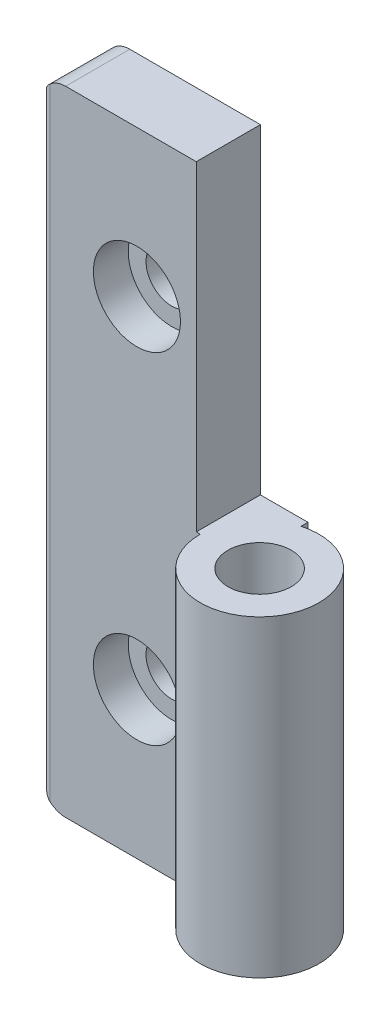
ISO-10303-21;
HEADER;
FILE_DESCRIPTION(('STEP AP214'),'2;1');
FILE_NAME('part.step','',(''),(''),'','','');
FILE_SCHEMA(('AUTOMOTIVE_DESIGN { 1 0 10303 214 1 1 1 1 }'));
ENDSEC;
DATA;
#1=APPLICATION_CONTEXT('core data for automotive mechanical design processes');
#2=APPLICATION_PROTOCOL_DEFINITION('international standard','automotive_design',2000,#1);
#3=PRODUCT_CONTEXT('',#1,'mechanical');
#4=PRODUCT('Part','Part','',(#3));
#5=PRODUCT_RELATED_PRODUCT_CATEGORY('part','',(#4));
#6=PRODUCT_DEFINITION_FORMATION('','',#4);
#7=PRODUCT_DEFINITION_CONTEXT('part definition',#1,'design');
#8=PRODUCT_DEFINITION('design','',#6,#7);
#9=PRODUCT_DEFINITION_SHAPE('','',#8);
#10=(LENGTH_UNIT() NAMED_UNIT(*) SI_UNIT(.MILLI.,.METRE.));
#11=(NAMED_UNIT(*) PLANE_ANGLE_UNIT() SI_UNIT($,.RADIAN.));
#12=(NAMED_UNIT(*) SI_UNIT($,.STERADIAN.) SOLID_ANGLE_UNIT());
#13=UNCERTAINTY_MEASURE_WITH_UNIT(LENGTH_MEASURE(1.E-05),#10,'distance_accuracy_value','');
#14=(GEOMETRIC_REPRESENTATION_CONTEXT(3) GLOBAL_UNCERTAINTY_ASSIGNED_CONTEXT((#13)) GLOBAL_UNIT_ASSIGNED_CONTEXT((#10,
#11,#12)) REPRESENTATION_CONTEXT('',''));
#15=CARTESIAN_POINT('',(0.,0.,0.));
#16=DIRECTION('',(0.,0.,1.));
#17=DIRECTION('',(1.,0.,0.));
#18=AXIS2_PLACEMENT_3D('',#15,#16,#17);
#19=CARTESIAN_POINT('',(0.,-0.5,0.));
#20=DIRECTION('',(0.,-1.,0.));
#21=DIRECTION('',(0.,0.,-1.));
#22=AXIS2_PLACEMENT_3D('',#19,#20,#21);
#23=PLANE('',#22);
#24=CARTESIAN_POINT('',(0.,-0.5,0.));
#25=DIRECTION('',(0.,-1.,0.));
#26=DIRECTION('',(0.,0.,-1.));
#27=AXIS2_PLACEMENT_3D('',#24,#25,#26);
#28=CIRCLE('',#27,3.99999999999998);
#29=CARTESIAN_POINT('',(0.,-0.5,-3.99999999999998));
#30=VERTEX_POINT('',#29);
#31=EDGE_CURVE('E147',#30,#30,#28,.T.);
#32=ORIENTED_EDGE('',*,*,#31,.T.);
#33=EDGE_LOOP('',(#32));
#34=FACE_BOUND('',#33,.T.);
#35=DIRECTION('',(0.,0.,-1.));
#36=VECTOR('',#35,1.);
#37=CARTESIAN_POINT('',(-8.,-0.5,-8.1));
#38=LINE('',#37,#36);
#39=CARTESIAN_POINT('',(-8.,-0.5,0.));
#40=VERTEX_POINT('',#39);
#41=CARTESIAN_POINT('',(-8.,-0.5,-8.1));
#42=VERTEX_POINT('',#41);
#43=EDGE_CURVE('E119',#40,#42,#38,.T.);
#44=ORIENTED_EDGE('',*,*,#43,.F.);
#45=DIRECTION('',(-1.,0.,0.));
#46=VECTOR('',#45,1.);
#47=CARTESIAN_POINT('',(-7.5,-0.5,0.));
#48=LINE('',#47,#46);
#49=CARTESIAN_POINT('',(-7.5,-0.5,0.));
#50=VERTEX_POINT('',#49);
#51=EDGE_CURVE('E126',#50,#40,#48,.T.);
#52=ORIENTED_EDGE('',*,*,#51,.F.);
#53=CARTESIAN_POINT('',(0.,-0.5,0.));
#54=DIRECTION('',(0.,-1.,0.));
#55=DIRECTION('',(0.,0.,-1.));
#56=AXIS2_PLACEMENT_3D('',#53,#54,#55);
#57=CIRCLE('',#56,7.5);
#58=CARTESIAN_POINT('',(-2.,-0.5,-7.22841614740048));
#59=VERTEX_POINT('',#58);
#60=EDGE_CURVE('E267',#59,#50,#57,.T.);
#61=ORIENTED_EDGE('',*,*,#60,.F.);
#62=DIRECTION('',(0.,0.,1.));
#63=VECTOR('',#62,1.);
#64=CARTESIAN_POINT('',(-2.,-0.5,-8.1));
#65=LINE('',#64,#63);
#66=CARTESIAN_POINT('',(-2.,-0.5,-8.1));
#67=VERTEX_POINT('',#66);
#68=EDGE_CURVE('E265',#67,#59,#65,.T.);
#69=ORIENTED_EDGE('',*,*,#68,.F.);
#70=DIRECTION('',(1.,0.,0.));
#71=VECTOR('',#70,1.);
#72=CARTESIAN_POINT('',(-27.5,-0.5,-8.1));
#73=LINE('',#72,#71);
#74=EDGE_CURVE('E259',#42,#67,#73,.T.);
#75=ORIENTED_EDGE('',*,*,#74,.F.);
#76=EDGE_LOOP('',(#44,#52,#61,#69,#75));
#77=FACE_BOUND('',#76,.T.);
#78=ADVANCED_FACE('F32',(#34,#77),#23,.F.);
#79=CARTESIAN_POINT('',(-27.5,-0.5,-8.1));
#80=DIRECTION('',(0.,0.,-1.));
#81=DIRECTION('',(-1.,0.,0.));
#82=AXIS2_PLACEMENT_3D('',#79,#80,#81);
#83=PLANE('',#82);
#84=CARTESIAN_POINT('',(-15.5,-21.5,-8.1));
#85=DIRECTION('',(0.,0.,-1.));
#86=DIRECTION('',(-1.,0.,0.));
#87=AXIS2_PLACEMENT_3D('',#84,#85,#86);
#88=CIRCLE('',#87,3.25000000000001);
#89=CARTESIAN_POINT('',(-18.75,-21.5,-8.1));
#90=VERTEX_POINT('',#89);
#91=EDGE_CURVE('E162',#90,#90,#88,.T.);
#92=ORIENTED_EDGE('',*,*,#91,.F.);
#93=EDGE_LOOP('',(#92));
#94=FACE_BOUND('',#93,.T.);
#95=CARTESIAN_POINT('',(-15.5,21.5,-8.1));
#96=DIRECTION('',(0.,0.,-1.));
#97=DIRECTION('',(-1.,0.,0.));
#98=AXIS2_PLACEMENT_3D('',#95,#96,#97);
#99=CIRCLE('',#98,3.25000000000001);
#100=CARTESIAN_POINT('',(-18.75,21.5,-8.1));
#101=VERTEX_POINT('',#100);
#102=EDGE_CURVE('E158',#101,#101,#99,.T.);
#103=ORIENTED_EDGE('',*,*,#102,.F.);
#104=EDGE_LOOP('',(#103));
#105=FACE_BOUND('',#104,.T.);
#106=DIRECTION('',(1.,0.,0.));
#107=VECTOR('',#106,1.);
#108=CARTESIAN_POINT('',(-27.5,-40.,-8.1));
#109=LINE('',#108,#107);
#110=CARTESIAN_POINT('',(-24.5,-40.,-8.1));
#111=VERTEX_POINT('',#110);
#112=CARTESIAN_POINT('',(-2.,-40.,-8.1));
#113=VERTEX_POINT('',#112);
#114=EDGE_CURVE('E129',#111,#113,#109,.T.);
#115=ORIENTED_EDGE('',*,*,#114,.F.);
#116=CARTESIAN_POINT('',(-24.5,-37.,-8.1));
#117=DIRECTION('',(0.,0.,-1.));
#118=DIRECTION('',(-1.,0.,0.));
#119=AXIS2_PLACEMENT_3D('',#116,#117,#118);
#120=CIRCLE('',#119,2.99999999999999);
#121=CARTESIAN_POINT('',(-27.5,-37.,-8.1));
#122=VERTEX_POINT('',#121);
#123=EDGE_CURVE('E178',#111,#122,#120,.T.);
#124=ORIENTED_EDGE('',*,*,#123,.T.);
#125=DIRECTION('',(0.,-1.,0.));
#126=VECTOR('',#125,1.);
#127=CARTESIAN_POINT('',(-27.5,-0.5,-8.1));
#128=LINE('',#127,#126);
#129=CARTESIAN_POINT('',(-27.5,37.,-8.1));
#130=VERTEX_POINT('',#129);
#131=EDGE_CURVE('E170',#130,#122,#128,.T.);
#132=ORIENTED_EDGE('',*,*,#131,.F.);
#133=CARTESIAN_POINT('',(-24.5,37.,-8.1));
#134=DIRECTION('',(0.,0.,-1.));
#135=DIRECTION('',(-1.,0.,0.));
#136=AXIS2_PLACEMENT_3D('',#133,#134,#135);
#137=CIRCLE('',#136,2.99999999999999);
#138=CARTESIAN_POINT('',(-24.5,40.,-8.1));
#139=VERTEX_POINT('',#138);
#140=EDGE_CURVE('E176',#130,#139,#137,.T.);
#141=ORIENTED_EDGE('',*,*,#140,.T.);
#142=DIRECTION('',(-1.,0.,0.));
#143=VECTOR('',#142,1.);
#144=CARTESIAN_POINT('',(-27.5,40.,-8.1));
#145=LINE('',#144,#143);
#146=CARTESIAN_POINT('',(-8.,40.,-8.1));
#147=VERTEX_POINT('',#146);
#148=EDGE_CURVE('E135',#147,#139,#145,.T.);
#149=ORIENTED_EDGE('',*,*,#148,.F.);
#150=DIRECTION('',(0.,-1.,0.));
#151=VECTOR('',#150,1.);
#152=CARTESIAN_POINT('',(-8.,40.,-8.1));
#153=LINE('',#152,#151);
#154=EDGE_CURVE('E130',#147,#42,#153,.T.);
#155=ORIENTED_EDGE('',*,*,#154,.T.);
#156=ORIENTED_EDGE('',*,*,#74,.T.);
#157=DIRECTION('',(0.,-1.,0.));
#158=VECTOR('',#157,1.);
#159=CARTESIAN_POINT('',(-2.,-0.5,-8.1));
#160=LINE('',#159,#158);
#161=EDGE_CURVE('E245',#67,#113,#160,.T.);
#162=ORIENTED_EDGE('',*,*,#161,.T.);
#163=EDGE_LOOP('',(#115,#124,#132,#141,#149,#155,#156,#162));
#164=FACE_BOUND('',#163,.T.);
#165=ADVANCED_FACE('F200',(#94,#105,#164),#83,.T.);
#166=CARTESIAN_POINT('',(-27.5,-0.5,0.));
#167=DIRECTION('',(-1.,0.,0.));
#168=DIRECTION('',(0.,0.,1.));
#169=AXIS2_PLACEMENT_3D('',#166,#167,#168);
#170=PLANE('',#169);
#171=ORIENTED_EDGE('',*,*,#131,.T.);
#172=DIRECTION('',(0.,0.,-1.));
#173=VECTOR('',#172,1.);
#174=CARTESIAN_POINT('',(-27.5,-37.,0.));
#175=LINE('',#174,#173);
#176=CARTESIAN_POINT('',(-27.5,-37.,-1.));
#177=VERTEX_POINT('',#176);
#178=EDGE_CURVE('E182',#122,#177,#175,.F.);
#179=ORIENTED_EDGE('',*,*,#178,.T.);
#180=DIRECTION('',(0.,-1.,0.));
#181=VECTOR('',#180,1.);
#182=CARTESIAN_POINT('',(-27.5,-0.5,-1.));
#183=LINE('',#182,#181);
#184=CARTESIAN_POINT('',(-27.5,37.,-1.));
#185=VERTEX_POINT('',#184);
#186=EDGE_CURVE('E169',#177,#185,#183,.F.);
#187=ORIENTED_EDGE('',*,*,#186,.T.);
#188=DIRECTION('',(0.,0.,1.));
#189=VECTOR('',#188,1.);
#190=CARTESIAN_POINT('',(-27.5,37.,-8.1));
#191=LINE('',#190,#189);
#192=EDGE_CURVE('E180',#185,#130,#191,.F.);
#193=ORIENTED_EDGE('',*,*,#192,.T.);
#194=EDGE_LOOP('',(#171,#179,#187,#193));
#195=FACE_BOUND('',#194,.T.);
#196=ADVANCED_FACE('F215',(#195),#170,.T.);
#197=CARTESIAN_POINT('',(-7.5,-0.5,0.));
#198=DIRECTION('',(0.,0.,1.));
#199=DIRECTION('',(1.,0.,0.));
#200=AXIS2_PLACEMENT_3D('',#197,#198,#199);
#201=PLANE('',#200);
#202=CARTESIAN_POINT('',(-15.5,-21.5,0.));
#203=DIRECTION('',(0.,0.,1.));
#204=DIRECTION('',(1.,0.,0.));
#205=AXIS2_PLACEMENT_3D('',#202,#203,#204);
#206=CIRCLE('',#205,5.49999999999999);
#207=CARTESIAN_POINT('',(-10.,-21.5,0.));
#208=VERTEX_POINT('',#207);
#209=EDGE_CURVE('E432',#208,#208,#206,.T.);
#210=ORIENTED_EDGE('',*,*,#209,.F.);
#211=EDGE_LOOP('',(#210));
#212=FACE_BOUND('',#211,.T.);
#213=CARTESIAN_POINT('',(-15.5,21.5,0.));
#214=DIRECTION('',(0.,0.,1.));
#215=DIRECTION('',(1.,0.,0.));
#216=AXIS2_PLACEMENT_3D('',#213,#214,#215);
#217=CIRCLE('',#216,5.49999999999999);
#218=CARTESIAN_POINT('',(-10.,21.5,0.));
#219=VERTEX_POINT('',#218);
#220=EDGE_CURVE('E165',#219,#219,#217,.T.);
#221=ORIENTED_EDGE('',*,*,#220,.F.);
#222=EDGE_LOOP('',(#221));
#223=FACE_BOUND('',#222,.T.);
#224=DIRECTION('',(0.,-1.,0.));
#225=VECTOR('',#224,1.);
#226=CARTESIAN_POINT('',(-26.5,-0.5,0.));
#227=LINE('',#226,#225);
#228=CARTESIAN_POINT('',(-26.5,39.2360679774998,0.));
#229=VERTEX_POINT('',#228);
#230=CARTESIAN_POINT('',(-26.5,-39.2360679774998,0.));
#231=VERTEX_POINT('',#230);
#232=EDGE_CURVE('E167',#229,#231,#227,.T.);
#233=ORIENTED_EDGE('',*,*,#232,.T.);
#234=CARTESIAN_POINT('',(-24.5,-37.,0.));
#235=DIRECTION('',(0.,0.,1.));
#236=DIRECTION('',(1.,0.,0.));
#237=AXIS2_PLACEMENT_3D('',#234,#235,#236);
#238=CIRCLE('',#237,2.99999999999999);
#239=CARTESIAN_POINT('',(-24.5,-40.,0.));
#240=VERTEX_POINT('',#239);
#241=EDGE_CURVE('E41',#231,#240,#238,.T.);
#242=ORIENTED_EDGE('',*,*,#241,.T.);
#243=DIRECTION('',(-1.,0.,0.));
#244=VECTOR('',#243,1.);
#245=CARTESIAN_POINT('',(-7.5,-40.,0.));
#246=LINE('',#245,#244);
#247=CARTESIAN_POINT('',(-7.5,-40.,0.));
#248=VERTEX_POINT('',#247);
#249=EDGE_CURVE('E253',#248,#240,#246,.T.);
#250=ORIENTED_EDGE('',*,*,#249,.F.);
#251=DIRECTION('',(0.,-1.,0.));
#252=VECTOR('',#251,1.);
#253=CARTESIAN_POINT('',(-7.5,-0.5,0.));
#254=LINE('',#253,#252);
#255=EDGE_CURVE('E262',#50,#248,#254,.T.);
#256=ORIENTED_EDGE('',*,*,#255,.F.);
#257=ORIENTED_EDGE('',*,*,#51,.T.);
#258=DIRECTION('',(0.,-1.,0.));
#259=VECTOR('',#258,1.);
#260=CARTESIAN_POINT('',(-8.,40.,0.));
#261=LINE('',#260,#259);
#262=CARTESIAN_POINT('',(-8.,40.,0.));
#263=VERTEX_POINT('',#262);
#264=EDGE_CURVE('E123',#263,#40,#261,.T.);
#265=ORIENTED_EDGE('',*,*,#264,.F.);
#266=DIRECTION('',(1.,0.,0.));
#267=VECTOR('',#266,1.);
#268=CARTESIAN_POINT('',(-8.,40.,0.));
#269=LINE('',#268,#267);
#270=CARTESIAN_POINT('',(-24.5,40.,0.));
#271=VERTEX_POINT('',#270);
#272=EDGE_CURVE('E111',#271,#263,#269,.T.);
#273=ORIENTED_EDGE('',*,*,#272,.F.);
#274=CARTESIAN_POINT('',(-24.5,37.,0.));
#275=DIRECTION('',(0.,0.,1.));
#276=DIRECTION('',(1.,0.,0.));
#277=AXIS2_PLACEMENT_3D('',#274,#275,#276);
#278=CIRCLE('',#277,2.99999999999999);
#279=EDGE_CURVE('E48',#271,#229,#278,.T.);
#280=ORIENTED_EDGE('',*,*,#279,.T.);
#281=EDGE_LOOP('',(#233,#242,#250,#256,#257,#265,#273,#280));
#282=FACE_BOUND('',#281,.T.);
#283=ADVANCED_FACE('F124',(#212,#223,#282),#201,.T.);
#284=CARTESIAN_POINT('',(0.,-0.5,0.));
#285=DIRECTION('',(0.,-1.,0.));
#286=DIRECTION('',(0.,0.,-1.));
#287=AXIS2_PLACEMENT_3D('',#284,#285,#286);
#288=CYLINDRICAL_SURFACE('',#287,7.5);
#289=CARTESIAN_POINT('',(0.,-40.,0.));
#290=DIRECTION('',(0.,-1.,0.));
#291=DIRECTION('',(0.,0.,-1.));
#292=AXIS2_PLACEMENT_3D('',#289,#290,#291);
#293=CIRCLE('',#292,7.5);
#294=CARTESIAN_POINT('',(-2.,-40.,-7.22841614740048));
#295=VERTEX_POINT('',#294);
#296=EDGE_CURVE('E251',#295,#248,#293,.T.);
#297=ORIENTED_EDGE('',*,*,#296,.F.);
#298=DIRECTION('',(0.,-1.,0.));
#299=VECTOR('',#298,1.);
#300=CARTESIAN_POINT('',(-2.,-0.5,-7.22841614740048));
#301=LINE('',#300,#299);
#302=EDGE_CURVE('E247',#59,#295,#301,.T.);
#303=ORIENTED_EDGE('',*,*,#302,.F.);
#304=ORIENTED_EDGE('',*,*,#60,.T.);
#305=ORIENTED_EDGE('',*,*,#255,.T.);
#306=EDGE_LOOP('',(#297,#303,#304,#305));
#307=FACE_BOUND('',#306,.T.);
#308=ADVANCED_FACE('F231',(#307),#288,.T.);
#309=CARTESIAN_POINT('',(-2.,-0.5,-8.1));
#310=DIRECTION('',(1.,0.,0.));
#311=DIRECTION('',(0.,0.,-1.));
#312=AXIS2_PLACEMENT_3D('',#309,#310,#311);
#313=PLANE('',#312);
#314=DIRECTION('',(0.,0.,1.));
#315=VECTOR('',#314,1.);
#316=CARTESIAN_POINT('',(-2.,-40.,-8.1));
#317=LINE('',#316,#315);
#318=EDGE_CURVE('E242',#113,#295,#317,.T.);
#319=ORIENTED_EDGE('',*,*,#318,.F.);
#320=ORIENTED_EDGE('',*,*,#161,.F.);
#321=ORIENTED_EDGE('',*,*,#68,.T.);
#322=ORIENTED_EDGE('',*,*,#302,.T.);
#323=EDGE_LOOP('',(#319,#320,#321,#322));
#324=FACE_BOUND('',#323,.T.);
#325=ADVANCED_FACE('F224',(#324),#313,.T.);
#326=CARTESIAN_POINT('',(0.,-40.,0.));
#327=DIRECTION('',(0.,-1.,0.));
#328=DIRECTION('',(0.,0.,-1.));
#329=AXIS2_PLACEMENT_3D('',#326,#327,#328);
#330=PLANE('',#329);
#331=CARTESIAN_POINT('',(0.,-40.,0.));
#332=DIRECTION('',(0.,-1.,0.));
#333=DIRECTION('',(0.,0.,-1.));
#334=AXIS2_PLACEMENT_3D('',#331,#332,#333);
#335=CIRCLE('',#334,3.99999999999999);
#336=CARTESIAN_POINT('',(0.,-40.,-3.99999999999999));
#337=VERTEX_POINT('',#336);
#338=EDGE_CURVE('E157',#337,#337,#335,.T.);
#339=ORIENTED_EDGE('',*,*,#338,.F.);
#340=EDGE_LOOP('',(#339));
#341=FACE_BOUND('',#340,.T.);
#342=ORIENTED_EDGE('',*,*,#249,.T.);
#343=DIRECTION('',(0.,0.,-1.));
#344=VECTOR('',#343,1.);
#345=CARTESIAN_POINT('',(-24.5,-40.,0.));
#346=LINE('',#345,#344);
#347=EDGE_CURVE('E173',#240,#111,#346,.T.);
#348=ORIENTED_EDGE('',*,*,#347,.T.);
#349=ORIENTED_EDGE('',*,*,#114,.T.);
#350=ORIENTED_EDGE('',*,*,#318,.T.);
#351=ORIENTED_EDGE('',*,*,#296,.T.);
#352=EDGE_LOOP('',(#342,#348,#349,#350,#351));
#353=FACE_BOUND('',#352,.T.);
#354=ADVANCED_FACE('F221',(#341,#353),#330,.T.);
#355=CARTESIAN_POINT('',(-8.,40.,-8.1));
#356=DIRECTION('',(-1.,0.,0.));
#357=DIRECTION('',(0.,0.,1.));
#358=AXIS2_PLACEMENT_3D('',#355,#356,#357);
#359=PLANE('',#358);
#360=ORIENTED_EDGE('',*,*,#43,.T.);
#361=ORIENTED_EDGE('',*,*,#154,.F.);
#362=DIRECTION('',(0.,0.,-1.));
#363=VECTOR('',#362,1.);
#364=CARTESIAN_POINT('',(-8.,40.,-8.1));
#365=LINE('',#364,#363);
#366=EDGE_CURVE('E116',#263,#147,#365,.T.);
#367=ORIENTED_EDGE('',*,*,#366,.F.);
#368=ORIENTED_EDGE('',*,*,#264,.T.);
#369=EDGE_LOOP('',(#360,#361,#367,#368));
#370=FACE_BOUND('',#369,.T.);
#371=ADVANCED_FACE('F132',(#370),#359,.F.);
#372=CARTESIAN_POINT('',(0.,40.,0.));
#373=DIRECTION('',(0.,-1.,0.));
#374=DIRECTION('',(0.,0.,-1.));
#375=AXIS2_PLACEMENT_3D('',#372,#373,#374);
#376=PLANE('',#375);
#377=ORIENTED_EDGE('',*,*,#148,.T.);
#378=DIRECTION('',(0.,0.,1.));
#379=VECTOR('',#378,1.);
#380=CARTESIAN_POINT('',(-24.5,40.,-1.));
#381=LINE('',#380,#379);
#382=EDGE_CURVE('E11',#139,#271,#381,.T.);
#383=ORIENTED_EDGE('',*,*,#382,.T.);
#384=ORIENTED_EDGE('',*,*,#272,.T.);
#385=ORIENTED_EDGE('',*,*,#366,.T.);
#386=EDGE_LOOP('',(#377,#383,#384,#385));
#387=FACE_BOUND('',#386,.T.);
#388=ADVANCED_FACE('F114',(#387),#376,.F.);
#389=CARTESIAN_POINT('',(0.,-40.,0.));
#390=DIRECTION('',(0.,-1.,0.));
#391=DIRECTION('',(0.,0.,-1.));
#392=AXIS2_PLACEMENT_3D('',#389,#390,#391);
#393=CYLINDRICAL_SURFACE('',#392,3.99999999999998);
#394=ORIENTED_EDGE('',*,*,#338,.T.);
#395=EDGE_LOOP('',(#394));
#396=FACE_BOUND('',#395,.T.);
#397=ORIENTED_EDGE('',*,*,#31,.F.);
#398=EDGE_LOOP('',(#397));
#399=FACE_BOUND('',#398,.T.);
#400=ADVANCED_FACE('F298',(#396,#399),#393,.F.);
#401=CARTESIAN_POINT('',(-15.5,21.5,0.));
#402=DIRECTION('',(0.,0.,1.));
#403=DIRECTION('',(1.,0.,0.));
#404=AXIS2_PLACEMENT_3D('',#401,#402,#403);
#405=CYLINDRICAL_SURFACE('',#404,3.25000000000001);
#406=ORIENTED_EDGE('',*,*,#102,.T.);
#407=EDGE_LOOP('',(#406));
#408=FACE_BOUND('',#407,.T.);
#409=CARTESIAN_POINT('',(-15.5,21.5,-4.4));
#410=DIRECTION('',(0.,0.,1.));
#411=DIRECTION('',(1.,0.,0.));
#412=AXIS2_PLACEMENT_3D('',#409,#410,#411);
#413=CIRCLE('',#412,3.25000000000001);
#414=CARTESIAN_POINT('',(-12.25,21.5,-4.4));
#415=VERTEX_POINT('',#414);
#416=EDGE_CURVE('E161',#415,#415,#413,.T.);
#417=ORIENTED_EDGE('',*,*,#416,.T.);
#418=EDGE_LOOP('',(#417));
#419=FACE_BOUND('',#418,.T.);
#420=ADVANCED_FACE('F305',(#408,#419),#405,.F.);
#421=CARTESIAN_POINT('',(-12.25,21.5,-4.4));
#422=DIRECTION('',(0.,0.,-1.));
#423=DIRECTION('',(-1.,0.,0.));
#424=AXIS2_PLACEMENT_3D('',#421,#422,#423);
#425=PLANE('',#424);
#426=ORIENTED_EDGE('',*,*,#416,.F.);
#427=EDGE_LOOP('',(#426));
#428=FACE_BOUND('',#427,.T.);
#429=CARTESIAN_POINT('',(-15.5,21.5,-4.4));
#430=DIRECTION('',(0.,0.,1.));
#431=DIRECTION('',(1.,0.,0.));
#432=AXIS2_PLACEMENT_3D('',#429,#430,#431);
#433=CIRCLE('',#432,5.49999999999999);
#434=CARTESIAN_POINT('',(-10.,21.5,-4.4));
#435=VERTEX_POINT('',#434);
#436=EDGE_CURVE('E440',#435,#435,#433,.T.);
#437=ORIENTED_EDGE('',*,*,#436,.T.);
#438=EDGE_LOOP('',(#437));
#439=FACE_BOUND('',#438,.T.);
#440=ADVANCED_FACE('F313',(#428,#439),#425,.F.);
#441=CARTESIAN_POINT('',(-15.5,21.5,0.));
#442=DIRECTION('',(0.,0.,1.));
#443=DIRECTION('',(1.,0.,0.));
#444=AXIS2_PLACEMENT_3D('',#441,#442,#443);
#445=CYLINDRICAL_SURFACE('',#444,5.49999999999999);
#446=ORIENTED_EDGE('',*,*,#436,.F.);
#447=EDGE_LOOP('',(#446));
#448=FACE_BOUND('',#447,.T.);
#449=ORIENTED_EDGE('',*,*,#220,.T.);
#450=EDGE_LOOP('',(#449));
#451=FACE_BOUND('',#450,.T.);
#452=ADVANCED_FACE('F321',(#448,#451),#445,.F.);
#453=CARTESIAN_POINT('',(-15.5,-21.5,0.));
#454=DIRECTION('',(0.,0.,1.));
#455=DIRECTION('',(1.,0.,0.));
#456=AXIS2_PLACEMENT_3D('',#453,#454,#455);
#457=CYLINDRICAL_SURFACE('',#456,3.25000000000001);
#458=ORIENTED_EDGE('',*,*,#91,.T.);
#459=EDGE_LOOP('',(#458));
#460=FACE_BOUND('',#459,.T.);
#461=CARTESIAN_POINT('',(-15.5,-21.5,-4.4));
#462=DIRECTION('',(0.,0.,1.));
#463=DIRECTION('',(1.,0.,0.));
#464=AXIS2_PLACEMENT_3D('',#461,#462,#463);
#465=CIRCLE('',#464,3.25000000000001);
#466=CARTESIAN_POINT('',(-12.25,-21.5,-4.4));
#467=VERTEX_POINT('',#466);
#468=EDGE_CURVE('E166',#467,#467,#465,.T.);
#469=ORIENTED_EDGE('',*,*,#468,.T.);
#470=EDGE_LOOP('',(#469));
#471=FACE_BOUND('',#470,.T.);
#472=ADVANCED_FACE('F329',(#460,#471),#457,.F.);
#473=CARTESIAN_POINT('',(-12.25,-21.5,-4.4));
#474=DIRECTION('',(0.,0.,-1.));
#475=DIRECTION('',(-1.,0.,0.));
#476=AXIS2_PLACEMENT_3D('',#473,#474,#475);
#477=PLANE('',#476);
#478=ORIENTED_EDGE('',*,*,#468,.F.);
#479=EDGE_LOOP('',(#478));
#480=FACE_BOUND('',#479,.T.);
#481=CARTESIAN_POINT('',(-15.5,-21.5,-4.4));
#482=DIRECTION('',(0.,0.,1.));
#483=DIRECTION('',(1.,0.,0.));
#484=AXIS2_PLACEMENT_3D('',#481,#482,#483);
#485=CIRCLE('',#484,5.49999999999999);
#486=CARTESIAN_POINT('',(-10.,-21.5,-4.4));
#487=VERTEX_POINT('',#486);
#488=EDGE_CURVE('E429',#487,#487,#485,.T.);
#489=ORIENTED_EDGE('',*,*,#488,.T.);
#490=EDGE_LOOP('',(#489));
#491=FACE_BOUND('',#490,.T.);
#492=ADVANCED_FACE('F337',(#480,#491),#477,.F.);
#493=CARTESIAN_POINT('',(-15.5,-21.5,0.));
#494=DIRECTION('',(0.,0.,1.));
#495=DIRECTION('',(1.,0.,0.));
#496=AXIS2_PLACEMENT_3D('',#493,#494,#495);
#497=CYLINDRICAL_SURFACE('',#496,5.49999999999999);
#498=ORIENTED_EDGE('',*,*,#488,.F.);
#499=EDGE_LOOP('',(#498));
#500=FACE_BOUND('',#499,.T.);
#501=ORIENTED_EDGE('',*,*,#209,.T.);
#502=EDGE_LOOP('',(#501));
#503=FACE_BOUND('',#502,.T.);
#504=ADVANCED_FACE('F199',(#500,#503),#497,.F.);
#505=CARTESIAN_POINT('',(-26.5,-0.5,-1.));
#506=DIRECTION('',(0.,-1.,0.));
#507=DIRECTION('',(0.,0.,-1.));
#508=AXIS2_PLACEMENT_3D('',#505,#506,#507);
#509=CYLINDRICAL_SURFACE('',#508,1.);
#510=ORIENTED_EDGE('',*,*,#186,.F.);
#511=CARTESIAN_POINT('',(-26.5,-39.2360679774998,0.));
#512=CARTESIAN_POINT('',(-26.5316578772173,-39.2077572937075,-4.55551071982798E-06));
#513=CARTESIAN_POINT('',(-26.562687444377,-39.1787885816354,-0.00150263052096987));
#514=CARTESIAN_POINT('',(-26.6233321725058,-39.1197274162069,-0.00716698518481823));
#515=CARTESIAN_POINT('',(-26.652949081136,-39.0896364379924,-0.0113298709753138));
#516=CARTESIAN_POINT('',(-26.7391262742663,-38.9983201473494,-0.0272642318094649));
#517=CARTESIAN_POINT('',(-26.7934948471067,-38.935618835025,-0.0424913092058036));
#518=CARTESIAN_POINT('',(-26.9295613572291,-38.7651445015374,-0.0924370178179932));
#519=CARTESIAN_POINT('',(-27.0057446330972,-38.6548259454961,-0.133388824712252));
#520=CARTESIAN_POINT('',(-27.1412372779232,-38.4287723628818,-0.228187305913893));
#521=CARTESIAN_POINT('',(-27.2004379140891,-38.3130077259145,-0.282113178334035));
#522=CARTESIAN_POINT('',(-27.2876689239468,-38.1122851667142,-0.381459073324638));
#523=CARTESIAN_POINT('',(-27.319766680889,-38.0280484674357,-0.424861251473696));
#524=CARTESIAN_POINT('',(-27.3759320021476,-37.8584871191475,-0.514664336115298));
#525=CARTESIAN_POINT('',(-27.3999955148087,-37.7731619436708,-0.561066741580467));
#526=CARTESIAN_POINT('',(-27.460402907647,-37.5165620419738,-0.703036580570084));
#527=CARTESIAN_POINT('',(-27.4852102334562,-37.3440816395096,-0.801666019614424));
#528=CARTESIAN_POINT('',(-27.4981840462985,-37.1175431072325,-0.932142301887711));
#529=CARTESIAN_POINT('',(-27.4998141662827,-37.0635187811286,-0.963327735185315));
#530=CARTESIAN_POINT('',(-27.4999949980915,-37.0063245855028,-0.996348494144039));
#531=CARTESIAN_POINT('',(-27.4999999978197,-37.0031623061903,-0.998174236846674));
#532=CARTESIAN_POINT('',(-27.5,-37.,-1.));
#533=B_SPLINE_CURVE_WITH_KNOTS('',3,(#511,#512,#513,#514,#515,#516,#517,#518,#519,#520,#521,
#522,#523,#524,#525,#526,#527,#528,#529,#530,#531,#532),.UNSPECIFIED.,.F.,.F.,(4,2,2,2,2,2,2,2,
2,2,4),(0.,0.127328124372213,0.25449440731463,0.506902758847992,0.925154347494123,
1.34602692875662,1.64578712718785,1.94569826663479,2.54344782717993,2.7306215879237,
2.7415760493441),.UNSPECIFIED.);
#534=EDGE_CURVE('E55',#177,#231,#533,.F.);
#535=ORIENTED_EDGE('',*,*,#534,.T.);
#536=ORIENTED_EDGE('',*,*,#232,.F.);
#537=CARTESIAN_POINT('',(-26.5,39.2360679774998,0.));
#538=CARTESIAN_POINT('',(-26.5316578772173,39.2077572937075,-4.55551071982798E-06));
#539=CARTESIAN_POINT('',(-26.562687444377,39.1787885816354,-0.00150263052096987));
#540=CARTESIAN_POINT('',(-26.6233321725058,39.1197274162069,-0.00716698518481823));
#541=CARTESIAN_POINT('',(-26.652949081136,39.0896364379924,-0.0113298709753138));
#542=CARTESIAN_POINT('',(-26.7391262742663,38.9983201473494,-0.0272642318094649));
#543=CARTESIAN_POINT('',(-26.7934948471067,38.935618835025,-0.0424913092058036));
#544=CARTESIAN_POINT('',(-26.9295613572291,38.7651445015374,-0.0924370178179932));
#545=CARTESIAN_POINT('',(-27.0057446330972,38.6548259454961,-0.133388824712252));
#546=CARTESIAN_POINT('',(-27.1412372779232,38.4287723628818,-0.228187305913893));
#547=CARTESIAN_POINT('',(-27.2004379140891,38.3130077259145,-0.282113178334035));
#548=CARTESIAN_POINT('',(-27.2876689239468,38.1122851667142,-0.381459073324638));
#549=CARTESIAN_POINT('',(-27.319766680889,38.0280484674357,-0.424861251473696));
#550=CARTESIAN_POINT('',(-27.3759320021476,37.8584871191475,-0.514664336115298));
#551=CARTESIAN_POINT('',(-27.3999955148087,37.7731619436708,-0.561066741580467));
#552=CARTESIAN_POINT('',(-27.460402907647,37.5165620419738,-0.703036580570084));
#553=CARTESIAN_POINT('',(-27.4852102334562,37.3440816395096,-0.801666019614424));
#554=CARTESIAN_POINT('',(-27.4981840462985,37.1175431072325,-0.932142301887711));
#555=CARTESIAN_POINT('',(-27.4998141662827,37.0635187811286,-0.963327735185315));
#556=CARTESIAN_POINT('',(-27.4999949980915,37.0063245855028,-0.996348494144039));
#557=CARTESIAN_POINT('',(-27.4999999978197,37.0031623061903,-0.998174236846674));
#558=CARTESIAN_POINT('',(-27.5,37.,-1.));
#559=B_SPLINE_CURVE_WITH_KNOTS('',3,(#537,#538,#539,#540,#541,#542,#543,#544,#545,#546,#547,
#548,#549,#550,#551,#552,#553,#554,#555,#556,#557,#558),.UNSPECIFIED.,.F.,.F.,(4,2,2,2,2,2,2,2,
2,2,4),(0.,0.127328124372213,0.25449440731463,0.506902758847992,0.925154347494123,
1.34602692875662,1.64578712718785,1.94569826663479,2.54344782717993,2.7306215879237,
2.7415760493441),.UNSPECIFIED.);
#560=EDGE_CURVE('E184',#229,#185,#559,.T.);
#561=ORIENTED_EDGE('',*,*,#560,.T.);
#562=EDGE_LOOP('',(#510,#535,#536,#561));
#563=FACE_BOUND('',#562,.T.);
#564=ADVANCED_FACE('F194',(#563),#509,.T.);
#565=CARTESIAN_POINT('',(-24.5,-37.,0.));
#566=DIRECTION('',(0.,0.,-1.));
#567=DIRECTION('',(-1.,0.,0.));
#568=AXIS2_PLACEMENT_3D('',#565,#566,#567);
#569=CYLINDRICAL_SURFACE('',#568,2.99999999999999);
#570=ORIENTED_EDGE('',*,*,#534,.F.);
#571=ORIENTED_EDGE('',*,*,#178,.F.);
#572=ORIENTED_EDGE('',*,*,#123,.F.);
#573=ORIENTED_EDGE('',*,*,#347,.F.);
#574=ORIENTED_EDGE('',*,*,#241,.F.);
#575=EDGE_LOOP('',(#570,#571,#572,#573,#574));
#576=FACE_BOUND('',#575,.T.);
#577=ADVANCED_FACE('F198',(#576),#569,.T.);
#578=CARTESIAN_POINT('',(-24.5,37.,0.));
#579=DIRECTION('',(0.,0.,-1.));
#580=DIRECTION('',(-1.,0.,0.));
#581=AXIS2_PLACEMENT_3D('',#578,#579,#580);
#582=CYLINDRICAL_SURFACE('',#581,2.99999999999999);
#583=ORIENTED_EDGE('',*,*,#140,.F.);
#584=ORIENTED_EDGE('',*,*,#192,.F.);
#585=ORIENTED_EDGE('',*,*,#560,.F.);
#586=ORIENTED_EDGE('',*,*,#279,.F.);
#587=ORIENTED_EDGE('',*,*,#382,.F.);
#588=EDGE_LOOP('',(#583,#584,#585,#586,#587));
#589=FACE_BOUND('',#588,.T.);
#590=ADVANCED_FACE('F34',(#589),#582,.T.);
#591=CLOSED_SHELL('',(#78,#165,#196,#283,#308,#325,#354,#371,#388,#400,#420,#440,#452,#472,#492,
#504,#564,#577,#590));
#592=MANIFOLD_SOLID_BREP('B2',#591);
#593=ADVANCED_BREP_SHAPE_REPRESENTATION('',(#18,#592),#14);
#594=SHAPE_DEFINITION_REPRESENTATION(#9,#593);
ENDSEC;
END-ISO-10303-21;
